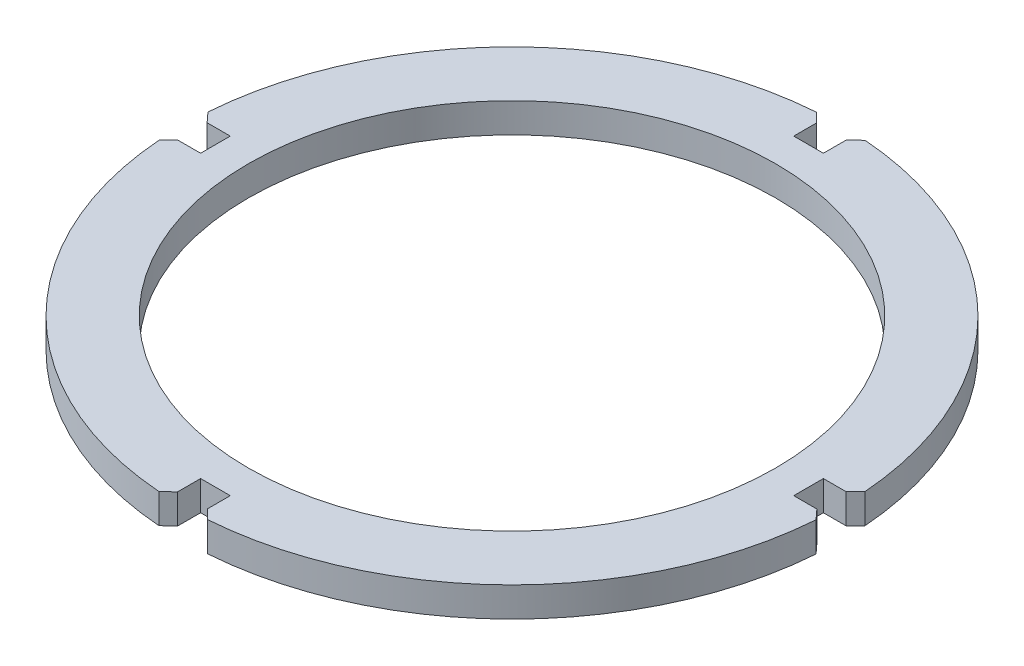
ISO-10303-21;
HEADER;
FILE_DESCRIPTION(('STEP AP214'),'2;1');
FILE_NAME('part.step','',(''),(''),'','','');
FILE_SCHEMA(('AUTOMOTIVE_DESIGN { 1 0 10303 214 1 1 1 1 }'));
ENDSEC;
DATA;
#1=APPLICATION_CONTEXT('core data for automotive mechanical design processes');
#2=APPLICATION_PROTOCOL_DEFINITION('international standard','automotive_design',2000,#1);
#3=PRODUCT_CONTEXT('',#1,'mechanical');
#4=PRODUCT('Part','Part','',(#3));
#5=PRODUCT_RELATED_PRODUCT_CATEGORY('part','',(#4));
#6=PRODUCT_DEFINITION_FORMATION('','',#4);
#7=PRODUCT_DEFINITION_CONTEXT('part definition',#1,'design');
#8=PRODUCT_DEFINITION('design','',#6,#7);
#9=PRODUCT_DEFINITION_SHAPE('','',#8);
#10=(LENGTH_UNIT() NAMED_UNIT(*) SI_UNIT(.MILLI.,.METRE.));
#11=(NAMED_UNIT(*) PLANE_ANGLE_UNIT() SI_UNIT($,.RADIAN.));
#12=(NAMED_UNIT(*) SI_UNIT($,.STERADIAN.) SOLID_ANGLE_UNIT());
#13=UNCERTAINTY_MEASURE_WITH_UNIT(LENGTH_MEASURE(1.E-05),#10,'distance_accuracy_value','');
#14=(GEOMETRIC_REPRESENTATION_CONTEXT(3) GLOBAL_UNCERTAINTY_ASSIGNED_CONTEXT((#13)) GLOBAL_UNIT_ASSIGNED_CONTEXT((#10,
#11,#12)) REPRESENTATION_CONTEXT('',''));
#15=CARTESIAN_POINT('',(0.,0.,0.));
#16=DIRECTION('',(0.,0.,1.));
#17=DIRECTION('',(1.,0.,0.));
#18=AXIS2_PLACEMENT_3D('',#15,#16,#17);
#19=CARTESIAN_POINT('',(-2.25000000000001,4.5,-49.9493493451116));
#20=DIRECTION('',(1.,0.,0.));
#21=DIRECTION('',(0.,0.,-1.));
#22=AXIS2_PLACEMENT_3D('',#19,#20,#21);
#23=PLANE('',#22);
#24=DIRECTION('',(0.,0.,1.));
#25=VECTOR('',#24,1.);
#26=CARTESIAN_POINT('',(-2.25000000000001,0.,-49.9493493451116));
#27=LINE('',#26,#25);
#28=CARTESIAN_POINT('',(-2.25000000000001,0.,-48.4493493451116));
#29=VERTEX_POINT('',#28);
#30=CARTESIAN_POINT('',(-2.25000000000001,0.,-45.));
#31=VERTEX_POINT('',#30);
#32=EDGE_CURVE('E258',#29,#31,#27,.T.);
#33=ORIENTED_EDGE('',*,*,#32,.F.);
#34=DIRECTION('',(0.,1.,0.));
#35=VECTOR('',#34,1.);
#36=CARTESIAN_POINT('',(-2.25000000000001,4.5,-48.4493493451116));
#37=LINE('',#36,#35);
#38=CARTESIAN_POINT('',(-2.25000000000001,4.5,-48.4493493451116));
#39=VERTEX_POINT('',#38);
#40=EDGE_CURVE('E203',#29,#39,#37,.T.);
#41=ORIENTED_EDGE('',*,*,#40,.T.);
#42=DIRECTION('',(0.,0.,1.));
#43=VECTOR('',#42,1.);
#44=CARTESIAN_POINT('',(-2.25000000000001,4.5,-49.9493493451116));
#45=LINE('',#44,#43);
#46=CARTESIAN_POINT('',(-2.25000000000001,4.5,-45.));
#47=VERTEX_POINT('',#46);
#48=EDGE_CURVE('E197',#39,#47,#45,.T.);
#49=ORIENTED_EDGE('',*,*,#48,.T.);
#50=DIRECTION('',(0.,-1.,0.));
#51=VECTOR('',#50,1.);
#52=CARTESIAN_POINT('',(-2.25000000000001,4.5,-45.));
#53=LINE('',#52,#51);
#54=EDGE_CURVE('E200',#47,#31,#53,.T.);
#55=ORIENTED_EDGE('',*,*,#54,.T.);
#56=EDGE_LOOP('',(#33,#41,#49,#55));
#57=FACE_BOUND('',#56,.T.);
#58=ADVANCED_FACE('F33',(#57),#23,.T.);
#59=CARTESIAN_POINT('',(0.,4.5,0.));
#60=DIRECTION('',(0.,-1.,0.));
#61=DIRECTION('',(0.,0.,-1.));
#62=AXIS2_PLACEMENT_3D('',#59,#60,#61);
#63=CYLINDRICAL_SURFACE('',#62,50.);
#64=CARTESIAN_POINT('',(0.,0.,0.));
#65=DIRECTION('',(0.,1.,0.));
#66=DIRECTION('',(0.,0.,1.));
#67=AXIS2_PLACEMENT_3D('',#64,#65,#66);
#68=CIRCLE('',#67,50.);
#69=CARTESIAN_POINT('',(-3.6660689192461,0.,-49.8654182643577));
#70=VERTEX_POINT('',#69);
#71=CARTESIAN_POINT('',(-49.8610009765848,0.,-3.72566525777803));
#72=VERTEX_POINT('',#71);
#73=EDGE_CURVE('E207',#70,#72,#68,.T.);
#74=ORIENTED_EDGE('',*,*,#73,.T.);
#75=DIRECTION('',(0.,-1.,0.));
#76=VECTOR('',#75,1.);
#77=CARTESIAN_POINT('',(-49.8610009765848,4.5,-3.72566525777803));
#78=LINE('',#77,#76);
#79=CARTESIAN_POINT('',(-49.8610009765848,4.5,-3.72566525777803));
#80=VERTEX_POINT('',#79);
#81=EDGE_CURVE('E359',#72,#80,#78,.F.);
#82=ORIENTED_EDGE('',*,*,#81,.T.);
#83=CARTESIAN_POINT('',(0.,4.5,0.));
#84=DIRECTION('',(0.,1.,0.));
#85=DIRECTION('',(0.,0.,1.));
#86=AXIS2_PLACEMENT_3D('',#83,#84,#85);
#87=CIRCLE('',#86,50.);
#88=CARTESIAN_POINT('',(-3.6660689192461,4.5,-49.8654182643577));
#89=VERTEX_POINT('',#88);
#90=EDGE_CURVE('E215',#89,#80,#87,.T.);
#91=ORIENTED_EDGE('',*,*,#90,.F.);
#92=DIRECTION('',(0.,-1.,0.));
#93=VECTOR('',#92,1.);
#94=CARTESIAN_POINT('',(-3.6660689192461,4.5,-49.8654182643577));
#95=LINE('',#94,#93);
#96=EDGE_CURVE('E356',#89,#70,#95,.T.);
#97=ORIENTED_EDGE('',*,*,#96,.T.);
#98=EDGE_LOOP('',(#74,#82,#91,#97));
#99=FACE_BOUND('',#98,.T.);
#100=ADVANCED_FACE('F435',(#99),#63,.T.);
#101=CARTESIAN_POINT('',(-45.,4.5,-2.24999999999999));
#102=DIRECTION('',(0.,0.,1.));
#103=DIRECTION('',(1.,0.,0.));
#104=AXIS2_PLACEMENT_3D('',#101,#102,#103);
#105=PLANE('',#104);
#106=DIRECTION('',(-1.,0.,0.));
#107=VECTOR('',#106,1.);
#108=CARTESIAN_POINT('',(-45.,4.5,-2.24999999999999));
#109=LINE('',#108,#107);
#110=CARTESIAN_POINT('',(-45.,4.5,-2.24999999999999));
#111=VERTEX_POINT('',#110);
#112=CARTESIAN_POINT('',(-48.5125498267087,4.5,-2.25));
#113=VERTEX_POINT('',#112);
#114=EDGE_CURVE('E253',#111,#113,#109,.T.);
#115=ORIENTED_EDGE('',*,*,#114,.T.);
#116=DIRECTION('',(0.,-1.,0.));
#117=VECTOR('',#116,1.);
#118=CARTESIAN_POINT('',(-48.5125498267087,0.,-2.25));
#119=LINE('',#118,#117);
#120=CARTESIAN_POINT('',(-48.5125498267087,0.,-2.25));
#121=VERTEX_POINT('',#120);
#122=EDGE_CURVE('E353',#113,#121,#119,.T.);
#123=ORIENTED_EDGE('',*,*,#122,.T.);
#124=DIRECTION('',(-1.,0.,0.));
#125=VECTOR('',#124,1.);
#126=CARTESIAN_POINT('',(-45.,0.,-2.24999999999999));
#127=LINE('',#126,#125);
#128=CARTESIAN_POINT('',(-45.,0.,-2.24999999999999));
#129=VERTEX_POINT('',#128);
#130=EDGE_CURVE('E294',#129,#121,#127,.T.);
#131=ORIENTED_EDGE('',*,*,#130,.F.);
#132=DIRECTION('',(0.,-1.,0.));
#133=VECTOR('',#132,1.);
#134=CARTESIAN_POINT('',(-45.,4.5,-2.24999999999999));
#135=LINE('',#134,#133);
#136=EDGE_CURVE('E299',#111,#129,#135,.T.);
#137=ORIENTED_EDGE('',*,*,#136,.F.);
#138=EDGE_LOOP('',(#115,#123,#131,#137));
#139=FACE_BOUND('',#138,.T.);
#140=ADVANCED_FACE('F443',(#139),#105,.T.);
#141=CARTESIAN_POINT('',(-45.,4.5,2.25));
#142=DIRECTION('',(-1.,0.,0.));
#143=DIRECTION('',(0.,0.,1.));
#144=AXIS2_PLACEMENT_3D('',#141,#142,#143);
#145=PLANE('',#144);
#146=DIRECTION('',(0.,0.,-1.));
#147=VECTOR('',#146,1.);
#148=CARTESIAN_POINT('',(-45.,0.,2.25));
#149=LINE('',#148,#147);
#150=CARTESIAN_POINT('',(-45.,0.,2.25));
#151=VERTEX_POINT('',#150);
#152=EDGE_CURVE('E291',#151,#129,#149,.T.);
#153=ORIENTED_EDGE('',*,*,#152,.F.);
#154=DIRECTION('',(0.,-1.,0.));
#155=VECTOR('',#154,1.);
#156=CARTESIAN_POINT('',(-45.,4.5,2.25));
#157=LINE('',#156,#155);
#158=CARTESIAN_POINT('',(-45.,4.5,2.25));
#159=VERTEX_POINT('',#158);
#160=EDGE_CURVE('E302',#159,#151,#157,.T.);
#161=ORIENTED_EDGE('',*,*,#160,.F.);
#162=DIRECTION('',(0.,0.,-1.));
#163=VECTOR('',#162,1.);
#164=CARTESIAN_POINT('',(-45.,4.5,2.25));
#165=LINE('',#164,#163);
#166=EDGE_CURVE('E250',#159,#111,#165,.T.);
#167=ORIENTED_EDGE('',*,*,#166,.T.);
#168=ORIENTED_EDGE('',*,*,#136,.T.);
#169=EDGE_LOOP('',(#153,#161,#167,#168));
#170=FACE_BOUND('',#169,.T.);
#171=ADVANCED_FACE('F447',(#170),#145,.T.);
#172=CARTESIAN_POINT('',(-49.9493493451116,4.5,2.25000000000001));
#173=DIRECTION('',(0.,0.,-1.));
#174=DIRECTION('',(-1.,0.,0.));
#175=AXIS2_PLACEMENT_3D('',#172,#173,#174);
#176=PLANE('',#175);
#177=DIRECTION('',(1.,0.,0.));
#178=VECTOR('',#177,1.);
#179=CARTESIAN_POINT('',(-49.9493493451116,0.,2.25000000000001));
#180=LINE('',#179,#178);
#181=CARTESIAN_POINT('',(-48.4493493451116,0.,2.25000000000001));
#182=VERTEX_POINT('',#181);
#183=EDGE_CURVE('E289',#182,#151,#180,.T.);
#184=ORIENTED_EDGE('',*,*,#183,.F.);
#185=DIRECTION('',(0.,1.,0.));
#186=VECTOR('',#185,1.);
#187=CARTESIAN_POINT('',(-48.4493493451116,4.5,2.25000000000001));
#188=LINE('',#187,#186);
#189=CARTESIAN_POINT('',(-48.4493493451116,4.5,2.25000000000001));
#190=VERTEX_POINT('',#189);
#191=EDGE_CURVE('E336',#182,#190,#188,.T.);
#192=ORIENTED_EDGE('',*,*,#191,.T.);
#193=DIRECTION('',(1.,0.,0.));
#194=VECTOR('',#193,1.);
#195=CARTESIAN_POINT('',(-49.9493493451116,4.5,2.25000000000001));
#196=LINE('',#195,#194);
#197=EDGE_CURVE('E248',#190,#159,#196,.T.);
#198=ORIENTED_EDGE('',*,*,#197,.T.);
#199=ORIENTED_EDGE('',*,*,#160,.T.);
#200=EDGE_LOOP('',(#184,#192,#198,#199));
#201=FACE_BOUND('',#200,.T.);
#202=ADVANCED_FACE('F522',(#201),#176,.T.);
#203=CARTESIAN_POINT('',(0.,4.5,0.));
#204=DIRECTION('',(0.,-1.,0.));
#205=DIRECTION('',(0.,0.,-1.));
#206=AXIS2_PLACEMENT_3D('',#203,#204,#205);
#207=CYLINDRICAL_SURFACE('',#206,50.);
#208=CARTESIAN_POINT('',(0.,4.5,0.));
#209=DIRECTION('',(0.,1.,0.));
#210=DIRECTION('',(0.,0.,1.));
#211=AXIS2_PLACEMENT_3D('',#208,#209,#210);
#212=CIRCLE('',#211,50.);
#213=CARTESIAN_POINT('',(-49.8654182643577,4.5,3.66606891924611));
#214=VERTEX_POINT('',#213);
#215=CARTESIAN_POINT('',(-3.72566525777803,4.5,49.8610009765848));
#216=VERTEX_POINT('',#215);
#217=EDGE_CURVE('E245',#214,#216,#212,.T.);
#218=ORIENTED_EDGE('',*,*,#217,.F.);
#219=DIRECTION('',(0.,-1.,0.));
#220=VECTOR('',#219,1.);
#221=CARTESIAN_POINT('',(-49.8654182643577,4.5,3.66606891924611));
#222=LINE('',#221,#220);
#223=CARTESIAN_POINT('',(-49.8654182643577,0.,3.66606891924611));
#224=VERTEX_POINT('',#223);
#225=EDGE_CURVE('E317',#214,#224,#222,.T.);
#226=ORIENTED_EDGE('',*,*,#225,.T.);
#227=CARTESIAN_POINT('',(0.,0.,0.));
#228=DIRECTION('',(0.,1.,0.));
#229=DIRECTION('',(0.,0.,1.));
#230=AXIS2_PLACEMENT_3D('',#227,#228,#229);
#231=CIRCLE('',#230,50.);
#232=CARTESIAN_POINT('',(-3.72566525777803,0.,49.8610009765848));
#233=VERTEX_POINT('',#232);
#234=EDGE_CURVE('E286',#224,#233,#231,.T.);
#235=ORIENTED_EDGE('',*,*,#234,.T.);
#236=DIRECTION('',(0.,-1.,0.));
#237=VECTOR('',#236,1.);
#238=CARTESIAN_POINT('',(-3.72566525777803,4.5,49.8610009765848));
#239=LINE('',#238,#237);
#240=EDGE_CURVE('E301',#233,#216,#239,.F.);
#241=ORIENTED_EDGE('',*,*,#240,.T.);
#242=EDGE_LOOP('',(#218,#226,#235,#241));
#243=FACE_BOUND('',#242,.T.);
#244=ADVANCED_FACE('F457',(#243),#207,.T.);
#245=CARTESIAN_POINT('',(-2.25,4.5,45.));
#246=DIRECTION('',(1.,0.,0.));
#247=DIRECTION('',(0.,0.,-1.));
#248=AXIS2_PLACEMENT_3D('',#245,#246,#247);
#249=PLANE('',#248);
#250=DIRECTION('',(0.,0.,1.));
#251=VECTOR('',#250,1.);
#252=CARTESIAN_POINT('',(-2.25,4.5,45.));
#253=LINE('',#252,#251);
#254=CARTESIAN_POINT('',(-2.25,4.5,45.));
#255=VERTEX_POINT('',#254);
#256=CARTESIAN_POINT('',(-2.25,4.5,48.5125498267087));
#257=VERTEX_POINT('',#256);
#258=EDGE_CURVE('E242',#255,#257,#253,.T.);
#259=ORIENTED_EDGE('',*,*,#258,.T.);
#260=DIRECTION('',(0.,-1.,0.));
#261=VECTOR('',#260,1.);
#262=CARTESIAN_POINT('',(-2.25,0.,48.5125498267087));
#263=LINE('',#262,#261);
#264=CARTESIAN_POINT('',(-2.25,0.,48.5125498267087));
#265=VERTEX_POINT('',#264);
#266=EDGE_CURVE('E11',#257,#265,#263,.T.);
#267=ORIENTED_EDGE('',*,*,#266,.T.);
#268=DIRECTION('',(0.,0.,1.));
#269=VECTOR('',#268,1.);
#270=CARTESIAN_POINT('',(-2.25,0.,45.));
#271=LINE('',#270,#269);
#272=CARTESIAN_POINT('',(-2.25,0.,45.));
#273=VERTEX_POINT('',#272);
#274=EDGE_CURVE('E283',#273,#265,#271,.T.);
#275=ORIENTED_EDGE('',*,*,#274,.F.);
#276=DIRECTION('',(0.,-1.,0.));
#277=VECTOR('',#276,1.);
#278=CARTESIAN_POINT('',(-2.25,4.5,45.));
#279=LINE('',#278,#277);
#280=EDGE_CURVE('E305',#255,#273,#279,.T.);
#281=ORIENTED_EDGE('',*,*,#280,.F.);
#282=EDGE_LOOP('',(#259,#267,#275,#281));
#283=FACE_BOUND('',#282,.T.);
#284=ADVANCED_FACE('F465',(#283),#249,.T.);
#285=CARTESIAN_POINT('',(2.25,4.5,45.));
#286=DIRECTION('',(0.,0.,1.));
#287=DIRECTION('',(1.,0.,0.));
#288=AXIS2_PLACEMENT_3D('',#285,#286,#287);
#289=PLANE('',#288);
#290=DIRECTION('',(-1.,0.,0.));
#291=VECTOR('',#290,1.);
#292=CARTESIAN_POINT('',(2.25,0.,45.));
#293=LINE('',#292,#291);
#294=CARTESIAN_POINT('',(2.25,0.,45.));
#295=VERTEX_POINT('',#294);
#296=EDGE_CURVE('E280',#295,#273,#293,.T.);
#297=ORIENTED_EDGE('',*,*,#296,.F.);
#298=DIRECTION('',(0.,-1.,0.));
#299=VECTOR('',#298,1.);
#300=CARTESIAN_POINT('',(2.25,4.5,45.));
#301=LINE('',#300,#299);
#302=CARTESIAN_POINT('',(2.25,4.5,45.));
#303=VERTEX_POINT('',#302);
#304=EDGE_CURVE('E307',#303,#295,#301,.T.);
#305=ORIENTED_EDGE('',*,*,#304,.F.);
#306=DIRECTION('',(-1.,0.,0.));
#307=VECTOR('',#306,1.);
#308=CARTESIAN_POINT('',(2.25,4.5,45.));
#309=LINE('',#308,#307);
#310=EDGE_CURVE('E239',#303,#255,#309,.T.);
#311=ORIENTED_EDGE('',*,*,#310,.T.);
#312=ORIENTED_EDGE('',*,*,#280,.T.);
#313=EDGE_LOOP('',(#297,#305,#311,#312));
#314=FACE_BOUND('',#313,.T.);
#315=ADVANCED_FACE('F468',(#314),#289,.T.);
#316=CARTESIAN_POINT('',(2.25,4.5,49.9493493451116));
#317=DIRECTION('',(-1.,0.,0.));
#318=DIRECTION('',(0.,0.,1.));
#319=AXIS2_PLACEMENT_3D('',#316,#317,#318);
#320=PLANE('',#319);
#321=DIRECTION('',(0.,0.,-1.));
#322=VECTOR('',#321,1.);
#323=CARTESIAN_POINT('',(2.25,0.,49.9493493451116));
#324=LINE('',#323,#322);
#325=CARTESIAN_POINT('',(2.25,0.,48.4493493451116));
#326=VERTEX_POINT('',#325);
#327=EDGE_CURVE('E278',#326,#295,#324,.T.);
#328=ORIENTED_EDGE('',*,*,#327,.F.);
#329=DIRECTION('',(0.,1.,0.));
#330=VECTOR('',#329,1.);
#331=CARTESIAN_POINT('',(2.25,4.5,48.4493493451116));
#332=LINE('',#331,#330);
#333=CARTESIAN_POINT('',(2.25,4.5,48.4493493451116));
#334=VERTEX_POINT('',#333);
#335=EDGE_CURVE('E41',#326,#334,#332,.T.);
#336=ORIENTED_EDGE('',*,*,#335,.T.);
#337=DIRECTION('',(0.,0.,-1.));
#338=VECTOR('',#337,1.);
#339=CARTESIAN_POINT('',(2.25,4.5,49.9493493451116));
#340=LINE('',#339,#338);
#341=EDGE_CURVE('E237',#334,#303,#340,.T.);
#342=ORIENTED_EDGE('',*,*,#341,.T.);
#343=ORIENTED_EDGE('',*,*,#304,.T.);
#344=EDGE_LOOP('',(#328,#336,#342,#343));
#345=FACE_BOUND('',#344,.T.);
#346=ADVANCED_FACE('F382',(#345),#320,.T.);
#347=CARTESIAN_POINT('',(0.,4.5,0.));
#348=DIRECTION('',(0.,-1.,0.));
#349=DIRECTION('',(0.,0.,-1.));
#350=AXIS2_PLACEMENT_3D('',#347,#348,#349);
#351=CYLINDRICAL_SURFACE('',#350,50.);
#352=CARTESIAN_POINT('',(0.,0.,0.));
#353=DIRECTION('',(0.,1.,0.));
#354=DIRECTION('',(0.,0.,1.));
#355=AXIS2_PLACEMENT_3D('',#352,#353,#354);
#356=CIRCLE('',#355,50.);
#357=CARTESIAN_POINT('',(3.66606891924611,0.,49.8654182643577));
#358=VERTEX_POINT('',#357);
#359=CARTESIAN_POINT('',(49.8610009765848,0.,3.72566525777799));
#360=VERTEX_POINT('',#359);
#361=EDGE_CURVE('E275',#358,#360,#356,.T.);
#362=ORIENTED_EDGE('',*,*,#361,.T.);
#363=DIRECTION('',(0.,-1.,0.));
#364=VECTOR('',#363,1.);
#365=CARTESIAN_POINT('',(49.8610009765848,4.5,3.72566525777799));
#366=LINE('',#365,#364);
#367=CARTESIAN_POINT('',(49.8610009765848,4.5,3.72566525777799));
#368=VERTEX_POINT('',#367);
#369=EDGE_CURVE('E375',#360,#368,#366,.F.);
#370=ORIENTED_EDGE('',*,*,#369,.T.);
#371=CARTESIAN_POINT('',(0.,4.5,0.));
#372=DIRECTION('',(0.,1.,0.));
#373=DIRECTION('',(0.,0.,1.));
#374=AXIS2_PLACEMENT_3D('',#371,#372,#373);
#375=CIRCLE('',#374,50.);
#376=CARTESIAN_POINT('',(3.66606891924611,4.5,49.8654182643577));
#377=VERTEX_POINT('',#376);
#378=EDGE_CURVE('E234',#377,#368,#375,.T.);
#379=ORIENTED_EDGE('',*,*,#378,.F.);
#380=DIRECTION('',(0.,-1.,0.));
#381=VECTOR('',#380,1.);
#382=CARTESIAN_POINT('',(3.66606891924611,4.5,49.8654182643577));
#383=LINE('',#382,#381);
#384=EDGE_CURVE('E372',#377,#358,#383,.T.);
#385=ORIENTED_EDGE('',*,*,#384,.T.);
#386=EDGE_LOOP('',(#362,#370,#379,#385));
#387=FACE_BOUND('',#386,.T.);
#388=ADVANCED_FACE('F393',(#387),#351,.T.);
#389=CARTESIAN_POINT('',(45.,4.5,2.25));
#390=DIRECTION('',(0.,0.,-1.));
#391=DIRECTION('',(-1.,0.,0.));
#392=AXIS2_PLACEMENT_3D('',#389,#390,#391);
#393=PLANE('',#392);
#394=DIRECTION('',(1.,0.,0.));
#395=VECTOR('',#394,1.);
#396=CARTESIAN_POINT('',(45.,4.5,2.25));
#397=LINE('',#396,#395);
#398=CARTESIAN_POINT('',(45.,4.5,2.25));
#399=VERTEX_POINT('',#398);
#400=CARTESIAN_POINT('',(48.5125498267087,4.5,2.25));
#401=VERTEX_POINT('',#400);
#402=EDGE_CURVE('E231',#399,#401,#397,.T.);
#403=ORIENTED_EDGE('',*,*,#402,.T.);
#404=DIRECTION('',(0.,-1.,0.));
#405=VECTOR('',#404,1.);
#406=CARTESIAN_POINT('',(48.5125498267087,0.,2.25));
#407=LINE('',#406,#405);
#408=CARTESIAN_POINT('',(48.5125498267087,0.,2.25));
#409=VERTEX_POINT('',#408);
#410=EDGE_CURVE('E369',#401,#409,#407,.T.);
#411=ORIENTED_EDGE('',*,*,#410,.T.);
#412=DIRECTION('',(1.,0.,0.));
#413=VECTOR('',#412,1.);
#414=CARTESIAN_POINT('',(45.,0.,2.25));
#415=LINE('',#414,#413);
#416=CARTESIAN_POINT('',(45.,0.,2.25));
#417=VERTEX_POINT('',#416);
#418=EDGE_CURVE('E272',#417,#409,#415,.T.);
#419=ORIENTED_EDGE('',*,*,#418,.F.);
#420=DIRECTION('',(0.,-1.,0.));
#421=VECTOR('',#420,1.);
#422=CARTESIAN_POINT('',(45.,4.5,2.25));
#423=LINE('',#422,#421);
#424=EDGE_CURVE('E310',#399,#417,#423,.T.);
#425=ORIENTED_EDGE('',*,*,#424,.F.);
#426=EDGE_LOOP('',(#403,#411,#419,#425));
#427=FACE_BOUND('',#426,.T.);
#428=ADVANCED_FACE('F404',(#427),#393,.T.);
#429=CARTESIAN_POINT('',(45.,4.5,-2.25));
#430=DIRECTION('',(1.,0.,0.));
#431=DIRECTION('',(0.,0.,-1.));
#432=AXIS2_PLACEMENT_3D('',#429,#430,#431);
#433=PLANE('',#432);
#434=DIRECTION('',(0.,0.,1.));
#435=VECTOR('',#434,1.);
#436=CARTESIAN_POINT('',(45.,0.,-2.25));
#437=LINE('',#436,#435);
#438=CARTESIAN_POINT('',(45.,0.,-2.25));
#439=VERTEX_POINT('',#438);
#440=EDGE_CURVE('E269',#439,#417,#437,.T.);
#441=ORIENTED_EDGE('',*,*,#440,.F.);
#442=DIRECTION('',(0.,-1.,0.));
#443=VECTOR('',#442,1.);
#444=CARTESIAN_POINT('',(45.,4.5,-2.25));
#445=LINE('',#444,#443);
#446=CARTESIAN_POINT('',(45.,4.5,-2.25));
#447=VERTEX_POINT('',#446);
#448=EDGE_CURVE('E312',#447,#439,#445,.T.);
#449=ORIENTED_EDGE('',*,*,#448,.F.);
#450=DIRECTION('',(0.,0.,1.));
#451=VECTOR('',#450,1.);
#452=CARTESIAN_POINT('',(45.,4.5,-2.25));
#453=LINE('',#452,#451);
#454=EDGE_CURVE('E228',#447,#399,#453,.T.);
#455=ORIENTED_EDGE('',*,*,#454,.T.);
#456=ORIENTED_EDGE('',*,*,#424,.T.);
#457=EDGE_LOOP('',(#441,#449,#455,#456));
#458=FACE_BOUND('',#457,.T.);
#459=ADVANCED_FACE('F411',(#458),#433,.T.);
#460=CARTESIAN_POINT('',(49.9493493451116,4.5,-2.25));
#461=DIRECTION('',(0.,0.,1.));
#462=DIRECTION('',(1.,0.,0.));
#463=AXIS2_PLACEMENT_3D('',#460,#461,#462);
#464=PLANE('',#463);
#465=DIRECTION('',(-1.,0.,0.));
#466=VECTOR('',#465,1.);
#467=CARTESIAN_POINT('',(49.9493493451116,0.,-2.25));
#468=LINE('',#467,#466);
#469=CARTESIAN_POINT('',(48.4493493451116,0.,-2.25));
#470=VERTEX_POINT('',#469);
#471=EDGE_CURVE('E267',#470,#439,#468,.T.);
#472=ORIENTED_EDGE('',*,*,#471,.F.);
#473=DIRECTION('',(0.,1.,0.));
#474=VECTOR('',#473,1.);
#475=CARTESIAN_POINT('',(48.4493493451116,4.5,-2.25));
#476=LINE('',#475,#474);
#477=CARTESIAN_POINT('',(48.4493493451116,4.5,-2.25));
#478=VERTEX_POINT('',#477);
#479=EDGE_CURVE('E377',#470,#478,#476,.T.);
#480=ORIENTED_EDGE('',*,*,#479,.T.);
#481=DIRECTION('',(-1.,0.,0.));
#482=VECTOR('',#481,1.);
#483=CARTESIAN_POINT('',(49.9493493451116,4.5,-2.25));
#484=LINE('',#483,#482);
#485=EDGE_CURVE('E226',#478,#447,#484,.T.);
#486=ORIENTED_EDGE('',*,*,#485,.T.);
#487=ORIENTED_EDGE('',*,*,#448,.T.);
#488=EDGE_LOOP('',(#472,#480,#486,#487));
#489=FACE_BOUND('',#488,.T.);
#490=ADVANCED_FACE('F414',(#489),#464,.T.);
#491=CARTESIAN_POINT('',(0.,4.5,0.));
#492=DIRECTION('',(0.,-1.,0.));
#493=DIRECTION('',(0.,0.,-1.));
#494=AXIS2_PLACEMENT_3D('',#491,#492,#493);
#495=CYLINDRICAL_SURFACE('',#494,50.);
#496=CARTESIAN_POINT('',(0.,0.,0.));
#497=DIRECTION('',(0.,1.,0.));
#498=DIRECTION('',(0.,0.,1.));
#499=AXIS2_PLACEMENT_3D('',#496,#497,#498);
#500=CIRCLE('',#499,50.);
#501=CARTESIAN_POINT('',(49.8654182643577,0.,-3.66606891924611));
#502=VERTEX_POINT('',#501);
#503=CARTESIAN_POINT('',(3.72566525777799,0.,-49.8610009765848));
#504=VERTEX_POINT('',#503);
#505=EDGE_CURVE('E265',#502,#504,#500,.T.);
#506=ORIENTED_EDGE('',*,*,#505,.T.);
#507=DIRECTION('',(0.,-1.,0.));
#508=VECTOR('',#507,1.);
#509=CARTESIAN_POINT('',(3.72566525777799,4.5,-49.8610009765848));
#510=LINE('',#509,#508);
#511=CARTESIAN_POINT('',(3.72566525777799,4.5,-49.8610009765848));
#512=VERTEX_POINT('',#511);
#513=EDGE_CURVE('E56',#504,#512,#510,.F.);
#514=ORIENTED_EDGE('',*,*,#513,.T.);
#515=CARTESIAN_POINT('',(0.,4.5,0.));
#516=DIRECTION('',(0.,1.,0.));
#517=DIRECTION('',(0.,0.,1.));
#518=AXIS2_PLACEMENT_3D('',#515,#516,#517);
#519=CIRCLE('',#518,50.);
#520=CARTESIAN_POINT('',(49.8654182643577,4.5,-3.66606891924611));
#521=VERTEX_POINT('',#520);
#522=EDGE_CURVE('E221',#521,#512,#519,.T.);
#523=ORIENTED_EDGE('',*,*,#522,.F.);
#524=DIRECTION('',(0.,-1.,0.));
#525=VECTOR('',#524,1.);
#526=CARTESIAN_POINT('',(49.8654182643577,4.5,-3.66606891924611));
#527=LINE('',#526,#525);
#528=EDGE_CURVE('E364',#521,#502,#527,.T.);
#529=ORIENTED_EDGE('',*,*,#528,.T.);
#530=EDGE_LOOP('',(#506,#514,#523,#529));
#531=FACE_BOUND('',#530,.T.);
#532=ADVANCED_FACE('F421',(#531),#495,.T.);
#533=CARTESIAN_POINT('',(2.24999999999999,4.5,-45.));
#534=DIRECTION('',(-1.,0.,0.));
#535=DIRECTION('',(0.,0.,1.));
#536=AXIS2_PLACEMENT_3D('',#533,#534,#535);
#537=PLANE('',#536);
#538=DIRECTION('',(0.,0.,-1.));
#539=VECTOR('',#538,1.);
#540=CARTESIAN_POINT('',(2.24999999999999,4.5,-45.));
#541=LINE('',#540,#539);
#542=CARTESIAN_POINT('',(2.24999999999999,4.5,-45.));
#543=VERTEX_POINT('',#542);
#544=CARTESIAN_POINT('',(2.24999999999999,4.5,-48.5125498267087));
#545=VERTEX_POINT('',#544);
#546=EDGE_CURVE('E219',#543,#545,#541,.T.);
#547=ORIENTED_EDGE('',*,*,#546,.T.);
#548=DIRECTION('',(0.,-1.,0.));
#549=VECTOR('',#548,1.);
#550=CARTESIAN_POINT('',(2.24999999999999,0.,-48.5125498267087));
#551=LINE('',#550,#549);
#552=CARTESIAN_POINT('',(2.24999999999999,0.,-48.5125498267087));
#553=VERTEX_POINT('',#552);
#554=EDGE_CURVE('E361',#545,#553,#551,.T.);
#555=ORIENTED_EDGE('',*,*,#554,.T.);
#556=DIRECTION('',(0.,0.,-1.));
#557=VECTOR('',#556,1.);
#558=CARTESIAN_POINT('',(2.24999999999999,0.,-45.));
#559=LINE('',#558,#557);
#560=CARTESIAN_POINT('',(2.24999999999999,0.,-45.));
#561=VERTEX_POINT('',#560);
#562=EDGE_CURVE('E262',#561,#553,#559,.T.);
#563=ORIENTED_EDGE('',*,*,#562,.F.);
#564=DIRECTION('',(0.,-1.,0.));
#565=VECTOR('',#564,1.);
#566=CARTESIAN_POINT('',(2.24999999999999,4.5,-45.));
#567=LINE('',#566,#565);
#568=EDGE_CURVE('E214',#543,#561,#567,.T.);
#569=ORIENTED_EDGE('',*,*,#568,.F.);
#570=EDGE_LOOP('',(#547,#555,#563,#569));
#571=FACE_BOUND('',#570,.T.);
#572=ADVANCED_FACE('F427',(#571),#537,.T.);
#573=CARTESIAN_POINT('',(-2.25000000000001,4.5,-45.));
#574=DIRECTION('',(0.,0.,-1.));
#575=DIRECTION('',(-1.,0.,0.));
#576=AXIS2_PLACEMENT_3D('',#573,#574,#575);
#577=PLANE('',#576);
#578=DIRECTION('',(1.,0.,0.));
#579=VECTOR('',#578,1.);
#580=CARTESIAN_POINT('',(-2.25000000000001,0.,-45.));
#581=LINE('',#580,#579);
#582=EDGE_CURVE('E213',#31,#561,#581,.T.);
#583=ORIENTED_EDGE('',*,*,#582,.F.);
#584=ORIENTED_EDGE('',*,*,#54,.F.);
#585=DIRECTION('',(1.,0.,0.));
#586=VECTOR('',#585,1.);
#587=CARTESIAN_POINT('',(-2.25000000000001,4.5,-45.));
#588=LINE('',#587,#586);
#589=EDGE_CURVE('E206',#47,#543,#588,.T.);
#590=ORIENTED_EDGE('',*,*,#589,.T.);
#591=ORIENTED_EDGE('',*,*,#568,.T.);
#592=EDGE_LOOP('',(#583,#584,#590,#591));
#593=FACE_BOUND('',#592,.T.);
#594=ADVANCED_FACE('F211',(#593),#577,.T.);
#595=CARTESIAN_POINT('',(0.,4.5,0.));
#596=DIRECTION('',(0.,1.,0.));
#597=DIRECTION('',(0.,0.,1.));
#598=AXIS2_PLACEMENT_3D('',#595,#596,#597);
#599=PLANE('',#598);
#600=CARTESIAN_POINT('',(0.,4.5,0.));
#601=DIRECTION('',(0.,1.,0.));
#602=DIRECTION('',(0.,0.,1.));
#603=AXIS2_PLACEMENT_3D('',#600,#601,#602);
#604=CIRCLE('',#603,40.);
#605=CARTESIAN_POINT('',(0.,4.5,40.));
#606=VERTEX_POINT('',#605);
#607=EDGE_CURVE('E260',#606,#606,#604,.T.);
#608=ORIENTED_EDGE('',*,*,#607,.F.);
#609=EDGE_LOOP('',(#608));
#610=FACE_BOUND('',#609,.T.);
#611=ORIENTED_EDGE('',*,*,#197,.F.);
#612=DIRECTION('',(0.707106781186546,0.,-0.707106781186549));
#613=VECTOR('',#612,1.);
#614=CARTESIAN_POINT('',(-23.0996746725559,4.5,-23.0996746725558));
#615=LINE('',#614,#613);
#616=EDGE_CURVE('E351',#190,#214,#615,.F.);
#617=ORIENTED_EDGE('',*,*,#616,.T.);
#618=ORIENTED_EDGE('',*,*,#217,.T.);
#619=DIRECTION('',(-0.738210277909083,0.,0.674570667602287));
#620=VECTOR('',#619,1.);
#621=CARTESIAN_POINT('',(23.1341844323791,4.5,25.3166844323793));
#622=LINE('',#621,#620);
#623=EDGE_CURVE('E338',#216,#257,#622,.F.);
#624=ORIENTED_EDGE('',*,*,#623,.T.);
#625=ORIENTED_EDGE('',*,*,#258,.F.);
#626=ORIENTED_EDGE('',*,*,#310,.F.);
#627=ORIENTED_EDGE('',*,*,#341,.F.);
#628=DIRECTION('',(-0.707106781186547,0.,-0.707106781186548));
#629=VECTOR('',#628,1.);
#630=CARTESIAN_POINT('',(-23.0996746725558,4.5,23.0996746725558));
#631=LINE('',#630,#629);
#632=EDGE_CURVE('E340',#334,#377,#631,.F.);
#633=ORIENTED_EDGE('',*,*,#632,.T.);
#634=ORIENTED_EDGE('',*,*,#378,.T.);
#635=DIRECTION('',(0.674570667602291,0.,0.738210277909079));
#636=VECTOR('',#635,1.);
#637=CARTESIAN_POINT('',(25.3166844323791,4.5,-23.1341844323791));
#638=LINE('',#637,#636);
#639=EDGE_CURVE('E344',#368,#401,#638,.F.);
#640=ORIENTED_EDGE('',*,*,#639,.T.);
#641=ORIENTED_EDGE('',*,*,#402,.F.);
#642=ORIENTED_EDGE('',*,*,#454,.F.);
#643=ORIENTED_EDGE('',*,*,#485,.F.);
#644=DIRECTION('',(-0.707106781186549,0.,0.707106781186546));
#645=VECTOR('',#644,1.);
#646=CARTESIAN_POINT('',(23.0996746725557,4.5,23.0996746725558));
#647=LINE('',#646,#645);
#648=EDGE_CURVE('E342',#478,#521,#647,.F.);
#649=ORIENTED_EDGE('',*,*,#648,.T.);
#650=ORIENTED_EDGE('',*,*,#522,.T.);
#651=DIRECTION('',(0.738210277909078,0.,-0.674570667602292));
#652=VECTOR('',#651,1.);
#653=CARTESIAN_POINT('',(-23.1341844323791,4.5,-25.316684432379));
#654=LINE('',#653,#652);
#655=EDGE_CURVE('E48',#512,#545,#654,.F.);
#656=ORIENTED_EDGE('',*,*,#655,.T.);
#657=ORIENTED_EDGE('',*,*,#546,.F.);
#658=ORIENTED_EDGE('',*,*,#589,.F.);
#659=ORIENTED_EDGE('',*,*,#48,.F.);
#660=DIRECTION('',(0.707106781186548,0.,0.707106781186547));
#661=VECTOR('',#660,1.);
#662=CARTESIAN_POINT('',(23.0996746725558,4.5,-23.0996746725558));
#663=LINE('',#662,#661);
#664=EDGE_CURVE('E346',#39,#89,#663,.F.);
#665=ORIENTED_EDGE('',*,*,#664,.T.);
#666=ORIENTED_EDGE('',*,*,#90,.T.);
#667=DIRECTION('',(-0.674570667602286,0.,-0.738210277909084));
#668=VECTOR('',#667,1.);
#669=CARTESIAN_POINT('',(-25.3166844323794,4.5,23.1341844323791));
#670=LINE('',#669,#668);
#671=EDGE_CURVE('E349',#80,#113,#670,.F.);
#672=ORIENTED_EDGE('',*,*,#671,.T.);
#673=ORIENTED_EDGE('',*,*,#114,.F.);
#674=ORIENTED_EDGE('',*,*,#166,.F.);
#675=EDGE_LOOP('',(#611,#617,#618,#624,#625,#626,#627,#633,#634,#640,#641,#642,#643,#649,#650,
#656,#657,#658,#659,#665,#666,#672,#673,#674));
#676=FACE_BOUND('',#675,.T.);
#677=ADVANCED_FACE('F218',(#610,#676),#599,.T.);
#678=CARTESIAN_POINT('',(0.,0.,0.));
#679=DIRECTION('',(0.,1.,0.));
#680=DIRECTION('',(0.,0.,1.));
#681=AXIS2_PLACEMENT_3D('',#678,#679,#680);
#682=PLANE('',#681);
#683=CARTESIAN_POINT('',(0.,0.,0.));
#684=DIRECTION('',(0.,1.,0.));
#685=DIRECTION('',(0.,0.,1.));
#686=AXIS2_PLACEMENT_3D('',#683,#684,#685);
#687=CIRCLE('',#686,40.);
#688=CARTESIAN_POINT('',(0.,0.,40.));
#689=VERTEX_POINT('',#688);
#690=EDGE_CURVE('E692',#689,#689,#687,.T.);
#691=ORIENTED_EDGE('',*,*,#690,.T.);
#692=EDGE_LOOP('',(#691));
#693=FACE_BOUND('',#692,.T.);
#694=ORIENTED_EDGE('',*,*,#234,.F.);
#695=DIRECTION('',(-0.707106781186546,0.,0.707106781186549));
#696=VECTOR('',#695,1.);
#697=CARTESIAN_POINT('',(-49.8654182643577,0.,3.66606891924612));
#698=LINE('',#697,#696);
#699=EDGE_CURVE('E334',#224,#182,#698,.F.);
#700=ORIENTED_EDGE('',*,*,#699,.T.);
#701=ORIENTED_EDGE('',*,*,#183,.T.);
#702=ORIENTED_EDGE('',*,*,#152,.T.);
#703=ORIENTED_EDGE('',*,*,#130,.T.);
#704=DIRECTION('',(0.674570667602286,0.,0.738210277909084));
#705=VECTOR('',#704,1.);
#706=CARTESIAN_POINT('',(-48.5125498267087,0.,-2.25));
#707=LINE('',#706,#705);
#708=EDGE_CURVE('E332',#121,#72,#707,.F.);
#709=ORIENTED_EDGE('',*,*,#708,.T.);
#710=ORIENTED_EDGE('',*,*,#73,.F.);
#711=DIRECTION('',(-0.707106781186548,0.,-0.707106781186547));
#712=VECTOR('',#711,1.);
#713=CARTESIAN_POINT('',(-3.66606891924611,0.,-49.8654182643577));
#714=LINE('',#713,#712);
#715=EDGE_CURVE('E328',#70,#29,#714,.F.);
#716=ORIENTED_EDGE('',*,*,#715,.T.);
#717=ORIENTED_EDGE('',*,*,#32,.T.);
#718=ORIENTED_EDGE('',*,*,#582,.T.);
#719=ORIENTED_EDGE('',*,*,#562,.T.);
#720=DIRECTION('',(-0.738210277909078,0.,0.674570667602292));
#721=VECTOR('',#720,1.);
#722=CARTESIAN_POINT('',(2.24999999999999,0.,-48.5125498267087));
#723=LINE('',#722,#721);
#724=EDGE_CURVE('E330',#553,#504,#723,.F.);
#725=ORIENTED_EDGE('',*,*,#724,.T.);
#726=ORIENTED_EDGE('',*,*,#505,.F.);
#727=DIRECTION('',(0.707106781186549,0.,-0.707106781186546));
#728=VECTOR('',#727,1.);
#729=CARTESIAN_POINT('',(49.8654182643577,0.,-3.66606891924612));
#730=LINE('',#729,#728);
#731=EDGE_CURVE('E324',#502,#470,#730,.F.);
#732=ORIENTED_EDGE('',*,*,#731,.T.);
#733=ORIENTED_EDGE('',*,*,#471,.T.);
#734=ORIENTED_EDGE('',*,*,#440,.T.);
#735=ORIENTED_EDGE('',*,*,#418,.T.);
#736=DIRECTION('',(-0.674570667602291,0.,-0.738210277909079));
#737=VECTOR('',#736,1.);
#738=CARTESIAN_POINT('',(48.5125498267087,0.,2.25));
#739=LINE('',#738,#737);
#740=EDGE_CURVE('E326',#409,#360,#739,.F.);
#741=ORIENTED_EDGE('',*,*,#740,.T.);
#742=ORIENTED_EDGE('',*,*,#361,.F.);
#743=DIRECTION('',(0.707106781186547,0.,0.707106781186548));
#744=VECTOR('',#743,1.);
#745=CARTESIAN_POINT('',(3.66606891924611,0.,49.8654182643577));
#746=LINE('',#745,#744);
#747=EDGE_CURVE('E322',#358,#326,#746,.F.);
#748=ORIENTED_EDGE('',*,*,#747,.T.);
#749=ORIENTED_EDGE('',*,*,#327,.T.);
#750=ORIENTED_EDGE('',*,*,#296,.T.);
#751=ORIENTED_EDGE('',*,*,#274,.T.);
#752=DIRECTION('',(0.738210277909083,0.,-0.674570667602287));
#753=VECTOR('',#752,1.);
#754=CARTESIAN_POINT('',(-2.25,0.,48.5125498267087));
#755=LINE('',#754,#753);
#756=EDGE_CURVE('E320',#265,#233,#755,.F.);
#757=ORIENTED_EDGE('',*,*,#756,.T.);
#758=EDGE_LOOP('',(#694,#700,#701,#702,#703,#709,#710,#716,#717,#718,#719,#725,#726,#732,#733,
#734,#735,#741,#742,#748,#749,#750,#751,#757));
#759=FACE_BOUND('',#758,.T.);
#760=ADVANCED_FACE('F397',(#693,#759),#682,.F.);
#761=CARTESIAN_POINT('',(-49.8654182643577,4.5,3.66606891924612));
#762=DIRECTION('',(0.707106781186549,0.,0.707106781186546));
#763=DIRECTION('',(0.,-1.,0.));
#764=AXIS2_PLACEMENT_3D('',#761,#762,#763);
#765=PLANE('',#764);
#766=ORIENTED_EDGE('',*,*,#616,.F.);
#767=ORIENTED_EDGE('',*,*,#191,.F.);
#768=ORIENTED_EDGE('',*,*,#699,.F.);
#769=ORIENTED_EDGE('',*,*,#225,.F.);
#770=EDGE_LOOP('',(#766,#767,#768,#769));
#771=FACE_BOUND('',#770,.T.);
#772=ADVANCED_FACE('F455',(#771),#765,.F.);
#773=CARTESIAN_POINT('',(-48.5125498267087,4.5,-2.25));
#774=DIRECTION('',(0.738210277909084,0.,-0.674570667602286));
#775=DIRECTION('',(0.,-1.,0.));
#776=AXIS2_PLACEMENT_3D('',#773,#774,#775);
#777=PLANE('',#776);
#778=ORIENTED_EDGE('',*,*,#671,.F.);
#779=ORIENTED_EDGE('',*,*,#81,.F.);
#780=ORIENTED_EDGE('',*,*,#708,.F.);
#781=ORIENTED_EDGE('',*,*,#122,.F.);
#782=EDGE_LOOP('',(#778,#779,#780,#781));
#783=FACE_BOUND('',#782,.T.);
#784=ADVANCED_FACE('F438',(#783),#777,.F.);
#785=CARTESIAN_POINT('',(2.24999999999999,4.5,-48.5125498267087));
#786=DIRECTION('',(0.674570667602292,0.,0.738210277909078));
#787=DIRECTION('',(0.,-1.,0.));
#788=AXIS2_PLACEMENT_3D('',#785,#786,#787);
#789=PLANE('',#788);
#790=ORIENTED_EDGE('',*,*,#655,.F.);
#791=ORIENTED_EDGE('',*,*,#513,.F.);
#792=ORIENTED_EDGE('',*,*,#724,.F.);
#793=ORIENTED_EDGE('',*,*,#554,.F.);
#794=EDGE_LOOP('',(#790,#791,#792,#793));
#795=FACE_BOUND('',#794,.T.);
#796=ADVANCED_FACE('F425',(#795),#789,.F.);
#797=CARTESIAN_POINT('',(-3.66606891924611,4.5,-49.8654182643577));
#798=DIRECTION('',(-0.707106781186547,0.,0.707106781186548));
#799=DIRECTION('',(0.,-1.,0.));
#800=AXIS2_PLACEMENT_3D('',#797,#798,#799);
#801=PLANE('',#800);
#802=ORIENTED_EDGE('',*,*,#664,.F.);
#803=ORIENTED_EDGE('',*,*,#40,.F.);
#804=ORIENTED_EDGE('',*,*,#715,.F.);
#805=ORIENTED_EDGE('',*,*,#96,.F.);
#806=EDGE_LOOP('',(#802,#803,#804,#805));
#807=FACE_BOUND('',#806,.T.);
#808=ADVANCED_FACE('F430',(#807),#801,.F.);
#809=CARTESIAN_POINT('',(48.5125498267087,4.5,2.25));
#810=DIRECTION('',(-0.738210277909079,0.,0.674570667602291));
#811=DIRECTION('',(0.,-1.,0.));
#812=AXIS2_PLACEMENT_3D('',#809,#810,#811);
#813=PLANE('',#812);
#814=ORIENTED_EDGE('',*,*,#639,.F.);
#815=ORIENTED_EDGE('',*,*,#369,.F.);
#816=ORIENTED_EDGE('',*,*,#740,.F.);
#817=ORIENTED_EDGE('',*,*,#410,.F.);
#818=EDGE_LOOP('',(#814,#815,#816,#817));
#819=FACE_BOUND('',#818,.T.);
#820=ADVANCED_FACE('F402',(#819),#813,.F.);
#821=CARTESIAN_POINT('',(49.8654182643577,4.5,-3.66606891924612));
#822=DIRECTION('',(-0.707106781186546,0.,-0.707106781186549));
#823=DIRECTION('',(0.,-1.,0.));
#824=AXIS2_PLACEMENT_3D('',#821,#822,#823);
#825=PLANE('',#824);
#826=ORIENTED_EDGE('',*,*,#648,.F.);
#827=ORIENTED_EDGE('',*,*,#479,.F.);
#828=ORIENTED_EDGE('',*,*,#731,.F.);
#829=ORIENTED_EDGE('',*,*,#528,.F.);
#830=EDGE_LOOP('',(#826,#827,#828,#829));
#831=FACE_BOUND('',#830,.T.);
#832=ADVANCED_FACE('F419',(#831),#825,.F.);
#833=CARTESIAN_POINT('',(3.66606891924611,4.5,49.8654182643577));
#834=DIRECTION('',(0.707106781186548,0.,-0.707106781186547));
#835=DIRECTION('',(0.,-1.,0.));
#836=AXIS2_PLACEMENT_3D('',#833,#834,#835);
#837=PLANE('',#836);
#838=ORIENTED_EDGE('',*,*,#632,.F.);
#839=ORIENTED_EDGE('',*,*,#335,.F.);
#840=ORIENTED_EDGE('',*,*,#747,.F.);
#841=ORIENTED_EDGE('',*,*,#384,.F.);
#842=EDGE_LOOP('',(#838,#839,#840,#841));
#843=FACE_BOUND('',#842,.T.);
#844=ADVANCED_FACE('F390',(#843),#837,.F.);
#845=CARTESIAN_POINT('',(-2.25,4.5,48.5125498267087));
#846=DIRECTION('',(-0.674570667602287,0.,-0.738210277909083));
#847=DIRECTION('',(0.,-1.,0.));
#848=AXIS2_PLACEMENT_3D('',#845,#846,#847);
#849=PLANE('',#848);
#850=ORIENTED_EDGE('',*,*,#623,.F.);
#851=ORIENTED_EDGE('',*,*,#240,.F.);
#852=ORIENTED_EDGE('',*,*,#756,.F.);
#853=ORIENTED_EDGE('',*,*,#266,.F.);
#854=EDGE_LOOP('',(#850,#851,#852,#853));
#855=FACE_BOUND('',#854,.T.);
#856=ADVANCED_FACE('F35',(#855),#849,.F.);
#857=CARTESIAN_POINT('',(0.,4.5,0.));
#858=DIRECTION('',(0.,-1.,0.));
#859=DIRECTION('',(0.,0.,-1.));
#860=AXIS2_PLACEMENT_3D('',#857,#858,#859);
#861=CYLINDRICAL_SURFACE('',#860,40.);
#862=ORIENTED_EDGE('',*,*,#607,.T.);
#863=EDGE_LOOP('',(#862));
#864=FACE_BOUND('',#863,.T.);
#865=ORIENTED_EDGE('',*,*,#690,.F.);
#866=EDGE_LOOP('',(#865));
#867=FACE_BOUND('',#866,.T.);
#868=ADVANCED_FACE('F501',(#864,#867),#861,.F.);
#869=CLOSED_SHELL('',(#58,#100,#140,#171,#202,#244,#284,#315,#346,#388,#428,#459,#490,#532,#572,
#594,#677,#760,#772,#784,#796,#808,#820,#832,#844,#856,#868));
#870=MANIFOLD_SOLID_BREP('B2',#869);
#871=ADVANCED_BREP_SHAPE_REPRESENTATION('',(#18,#870),#14);
#872=SHAPE_DEFINITION_REPRESENTATION(#9,#871);
ENDSEC;
END-ISO-10303-21;
